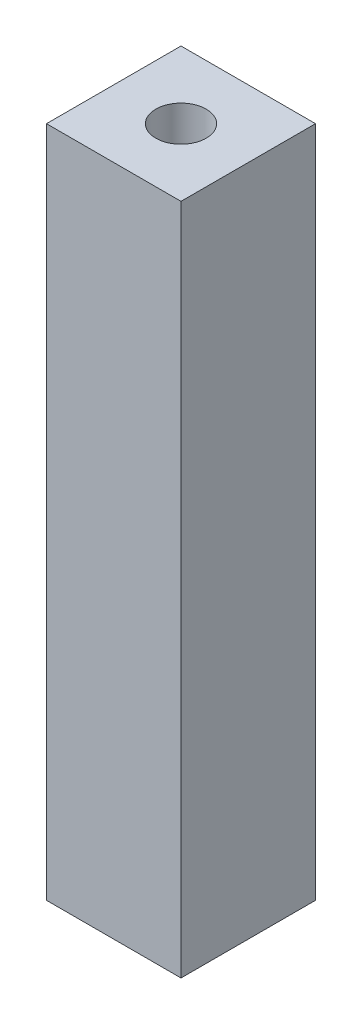
ISO-10303-21;
HEADER;
FILE_DESCRIPTION(('STEP AP214'),'2;1');
FILE_NAME('part.step','',(''),(''),'','','');
FILE_SCHEMA(('AUTOMOTIVE_DESIGN { 1 0 10303 214 1 1 1 1 }'));
ENDSEC;
DATA;
#1=APPLICATION_CONTEXT('core data for automotive mechanical design processes');
#2=APPLICATION_PROTOCOL_DEFINITION('international standard','automotive_design',2000,#1);
#3=PRODUCT_CONTEXT('',#1,'mechanical');
#4=PRODUCT('Part','Part','',(#3));
#5=PRODUCT_RELATED_PRODUCT_CATEGORY('part','',(#4));
#6=PRODUCT_DEFINITION_FORMATION('','',#4);
#7=PRODUCT_DEFINITION_CONTEXT('part definition',#1,'design');
#8=PRODUCT_DEFINITION('design','',#6,#7);
#9=PRODUCT_DEFINITION_SHAPE('','',#8);
#10=(LENGTH_UNIT() NAMED_UNIT(*) SI_UNIT(.MILLI.,.METRE.));
#11=(NAMED_UNIT(*) PLANE_ANGLE_UNIT() SI_UNIT($,.RADIAN.));
#12=(NAMED_UNIT(*) SI_UNIT($,.STERADIAN.) SOLID_ANGLE_UNIT());
#13=UNCERTAINTY_MEASURE_WITH_UNIT(LENGTH_MEASURE(1.E-05),#10,'distance_accuracy_value','');
#14=(GEOMETRIC_REPRESENTATION_CONTEXT(3) GLOBAL_UNCERTAINTY_ASSIGNED_CONTEXT((#13)) GLOBAL_UNIT_ASSIGNED_CONTEXT((#10,
#11,#12)) REPRESENTATION_CONTEXT('',''));
#15=CARTESIAN_POINT('',(0.,0.,0.));
#16=DIRECTION('',(0.,0.,1.));
#17=DIRECTION('',(1.,0.,0.));
#18=AXIS2_PLACEMENT_3D('',#15,#16,#17);
#19=CARTESIAN_POINT('',(4.,40.,4.));
#20=DIRECTION('',(-1.,0.,0.));
#21=DIRECTION('',(0.,0.,1.));
#22=AXIS2_PLACEMENT_3D('',#19,#20,#21);
#23=PLANE('',#22);
#24=DIRECTION('',(0.,0.,-1.));
#25=VECTOR('',#24,1.);
#26=CARTESIAN_POINT('',(4.,0.,4.));
#27=LINE('',#26,#25);
#28=CARTESIAN_POINT('',(4.,0.,4.));
#29=VERTEX_POINT('',#28);
#30=CARTESIAN_POINT('',(4.,0.,-4.));
#31=VERTEX_POINT('',#30);
#32=EDGE_CURVE('E96',#29,#31,#27,.T.);
#33=ORIENTED_EDGE('',*,*,#32,.T.);
#34=DIRECTION('',(0.,-1.,0.));
#35=VECTOR('',#34,1.);
#36=CARTESIAN_POINT('',(4.,40.,-4.));
#37=LINE('',#36,#35);
#38=CARTESIAN_POINT('',(4.,40.,-4.));
#39=VERTEX_POINT('',#38);
#40=EDGE_CURVE('E11',#39,#31,#37,.T.);
#41=ORIENTED_EDGE('',*,*,#40,.F.);
#42=DIRECTION('',(0.,0.,-1.));
#43=VECTOR('',#42,1.);
#44=CARTESIAN_POINT('',(4.,40.,4.));
#45=LINE('',#44,#43);
#46=CARTESIAN_POINT('',(4.,40.,4.));
#47=VERTEX_POINT('',#46);
#48=EDGE_CURVE('E84',#47,#39,#45,.T.);
#49=ORIENTED_EDGE('',*,*,#48,.F.);
#50=DIRECTION('',(0.,-1.,0.));
#51=VECTOR('',#50,1.);
#52=CARTESIAN_POINT('',(4.,40.,4.));
#53=LINE('',#52,#51);
#54=EDGE_CURVE('E92',#47,#29,#53,.T.);
#55=ORIENTED_EDGE('',*,*,#54,.T.);
#56=EDGE_LOOP('',(#33,#41,#49,#55));
#57=FACE_BOUND('',#56,.T.);
#58=ADVANCED_FACE('F33',(#57),#23,.F.);
#59=CARTESIAN_POINT('',(-4.,40.,-4.));
#60=DIRECTION('',(0.,0.,1.));
#61=DIRECTION('',(1.,0.,0.));
#62=AXIS2_PLACEMENT_3D('',#59,#60,#61);
#63=PLANE('',#62);
#64=DIRECTION('',(-1.,0.,0.));
#65=VECTOR('',#64,1.);
#66=CARTESIAN_POINT('',(-4.,0.,-4.));
#67=LINE('',#66,#65);
#68=CARTESIAN_POINT('',(-4.,0.,-4.));
#69=VERTEX_POINT('',#68);
#70=EDGE_CURVE('E88',#31,#69,#67,.T.);
#71=ORIENTED_EDGE('',*,*,#70,.T.);
#72=DIRECTION('',(0.,-1.,0.));
#73=VECTOR('',#72,1.);
#74=CARTESIAN_POINT('',(-4.,40.,-4.));
#75=LINE('',#74,#73);
#76=CARTESIAN_POINT('',(-4.,40.,-4.));
#77=VERTEX_POINT('',#76);
#78=EDGE_CURVE('E41',#77,#69,#75,.T.);
#79=ORIENTED_EDGE('',*,*,#78,.F.);
#80=DIRECTION('',(-1.,0.,0.));
#81=VECTOR('',#80,1.);
#82=CARTESIAN_POINT('',(-4.,40.,-4.));
#83=LINE('',#82,#81);
#84=EDGE_CURVE('E79',#39,#77,#83,.T.);
#85=ORIENTED_EDGE('',*,*,#84,.F.);
#86=ORIENTED_EDGE('',*,*,#40,.T.);
#87=EDGE_LOOP('',(#71,#79,#85,#86));
#88=FACE_BOUND('',#87,.T.);
#89=ADVANCED_FACE('F87',(#88),#63,.F.);
#90=CARTESIAN_POINT('',(-4.,40.,4.));
#91=DIRECTION('',(1.,0.,0.));
#92=DIRECTION('',(0.,0.,-1.));
#93=AXIS2_PLACEMENT_3D('',#90,#91,#92);
#94=PLANE('',#93);
#95=DIRECTION('',(0.,0.,1.));
#96=VECTOR('',#95,1.);
#97=CARTESIAN_POINT('',(-4.,0.,4.));
#98=LINE('',#97,#96);
#99=CARTESIAN_POINT('',(-4.,0.,4.));
#100=VERTEX_POINT('',#99);
#101=EDGE_CURVE('E66',#69,#100,#98,.T.);
#102=ORIENTED_EDGE('',*,*,#101,.T.);
#103=DIRECTION('',(0.,-1.,0.));
#104=VECTOR('',#103,1.);
#105=CARTESIAN_POINT('',(-4.,40.,4.));
#106=LINE('',#105,#104);
#107=CARTESIAN_POINT('',(-4.,40.,4.));
#108=VERTEX_POINT('',#107);
#109=EDGE_CURVE('E89',#108,#100,#106,.T.);
#110=ORIENTED_EDGE('',*,*,#109,.F.);
#111=DIRECTION('',(0.,0.,1.));
#112=VECTOR('',#111,1.);
#113=CARTESIAN_POINT('',(-4.,40.,4.));
#114=LINE('',#113,#112);
#115=EDGE_CURVE('E82',#77,#108,#114,.T.);
#116=ORIENTED_EDGE('',*,*,#115,.F.);
#117=ORIENTED_EDGE('',*,*,#78,.T.);
#118=EDGE_LOOP('',(#102,#110,#116,#117));
#119=FACE_BOUND('',#118,.T.);
#120=ADVANCED_FACE('F90',(#119),#94,.F.);
#121=CARTESIAN_POINT('',(-4.,40.,4.));
#122=DIRECTION('',(0.,0.,-1.));
#123=DIRECTION('',(-1.,0.,0.));
#124=AXIS2_PLACEMENT_3D('',#121,#122,#123);
#125=PLANE('',#124);
#126=DIRECTION('',(1.,0.,0.));
#127=VECTOR('',#126,1.);
#128=CARTESIAN_POINT('',(-4.,0.,4.));
#129=LINE('',#128,#127);
#130=EDGE_CURVE('E72',#100,#29,#129,.T.);
#131=ORIENTED_EDGE('',*,*,#130,.T.);
#132=ORIENTED_EDGE('',*,*,#54,.F.);
#133=DIRECTION('',(1.,0.,0.));
#134=VECTOR('',#133,1.);
#135=CARTESIAN_POINT('',(-4.,40.,4.));
#136=LINE('',#135,#134);
#137=EDGE_CURVE('E49',#108,#47,#136,.T.);
#138=ORIENTED_EDGE('',*,*,#137,.F.);
#139=ORIENTED_EDGE('',*,*,#109,.T.);
#140=EDGE_LOOP('',(#131,#132,#138,#139));
#141=FACE_BOUND('',#140,.T.);
#142=ADVANCED_FACE('F104',(#141),#125,.F.);
#143=CARTESIAN_POINT('',(0.,40.,0.));
#144=DIRECTION('',(0.,-1.,0.));
#145=DIRECTION('',(0.,0.,-1.));
#146=AXIS2_PLACEMENT_3D('',#143,#144,#145);
#147=PLANE('',#146);
#148=CARTESIAN_POINT('',(0.,40.,0.));
#149=DIRECTION('',(0.,1.,0.));
#150=DIRECTION('',(0.,0.,1.));
#151=AXIS2_PLACEMENT_3D('',#148,#149,#150);
#152=CIRCLE('',#151,1.5);
#153=CARTESIAN_POINT('',(0.,40.,1.5));
#154=VERTEX_POINT('',#153);
#155=EDGE_CURVE('E110',#154,#154,#152,.T.);
#156=ORIENTED_EDGE('',*,*,#155,.F.);
#157=EDGE_LOOP('',(#156));
#158=FACE_BOUND('',#157,.T.);
#159=ORIENTED_EDGE('',*,*,#48,.T.);
#160=ORIENTED_EDGE('',*,*,#84,.T.);
#161=ORIENTED_EDGE('',*,*,#115,.T.);
#162=ORIENTED_EDGE('',*,*,#137,.T.);
#163=EDGE_LOOP('',(#159,#160,#161,#162));
#164=FACE_BOUND('',#163,.T.);
#165=ADVANCED_FACE('F80',(#158,#164),#147,.F.);
#166=CARTESIAN_POINT('',(0.,0.,0.));
#167=DIRECTION('',(0.,-1.,0.));
#168=DIRECTION('',(0.,0.,-1.));
#169=AXIS2_PLACEMENT_3D('',#166,#167,#168);
#170=PLANE('',#169);
#171=CARTESIAN_POINT('',(0.,0.,0.));
#172=DIRECTION('',(0.,1.,0.));
#173=DIRECTION('',(0.,0.,1.));
#174=AXIS2_PLACEMENT_3D('',#171,#172,#173);
#175=CIRCLE('',#174,1.5);
#176=CARTESIAN_POINT('',(0.,0.,1.5));
#177=VERTEX_POINT('',#176);
#178=EDGE_CURVE('E99',#177,#177,#175,.T.);
#179=ORIENTED_EDGE('',*,*,#178,.T.);
#180=EDGE_LOOP('',(#179));
#181=FACE_BOUND('',#180,.T.);
#182=ORIENTED_EDGE('',*,*,#32,.F.);
#183=ORIENTED_EDGE('',*,*,#130,.F.);
#184=ORIENTED_EDGE('',*,*,#101,.F.);
#185=ORIENTED_EDGE('',*,*,#70,.F.);
#186=EDGE_LOOP('',(#182,#183,#184,#185));
#187=FACE_BOUND('',#186,.T.);
#188=ADVANCED_FACE('F107',(#181,#187),#170,.T.);
#189=CARTESIAN_POINT('',(0.,0.,0.));
#190=DIRECTION('',(0.,1.,0.));
#191=DIRECTION('',(0.,0.,1.));
#192=AXIS2_PLACEMENT_3D('',#189,#190,#191);
#193=CYLINDRICAL_SURFACE('',#192,1.5);
#194=ORIENTED_EDGE('',*,*,#178,.F.);
#195=EDGE_LOOP('',(#194));
#196=FACE_BOUND('',#195,.T.);
#197=ORIENTED_EDGE('',*,*,#155,.T.);
#198=EDGE_LOOP('',(#197));
#199=FACE_BOUND('',#198,.T.);
#200=ADVANCED_FACE('F117',(#196,#199),#193,.F.);
#201=CLOSED_SHELL('',(#58,#89,#120,#142,#165,#188,#200));
#202=MANIFOLD_SOLID_BREP('B2',#201);
#203=ADVANCED_BREP_SHAPE_REPRESENTATION('',(#18,#202),#14);
#204=SHAPE_DEFINITION_REPRESENTATION(#9,#203);
ENDSEC;
END-ISO-10303-21;
